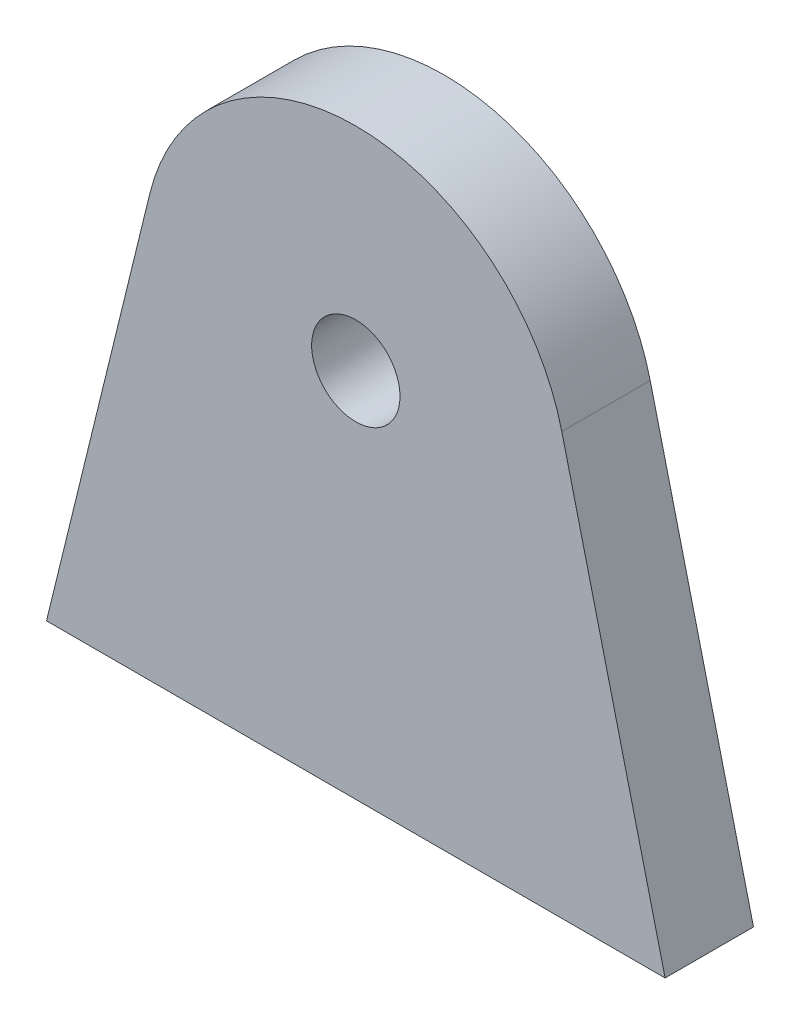
ISO-10303-21;
HEADER;
FILE_DESCRIPTION(('STEP AP214'),'2;1');
FILE_NAME('part.step','',(''),(''),'','','');
FILE_SCHEMA(('AUTOMOTIVE_DESIGN { 1 0 10303 214 1 1 1 1 }'));
ENDSEC;
DATA;
#1=APPLICATION_CONTEXT('core data for automotive mechanical design processes');
#2=APPLICATION_PROTOCOL_DEFINITION('international standard','automotive_design',2000,#1);
#3=PRODUCT_CONTEXT('',#1,'mechanical');
#4=PRODUCT('Part','Part','',(#3));
#5=PRODUCT_RELATED_PRODUCT_CATEGORY('part','',(#4));
#6=PRODUCT_DEFINITION_FORMATION('','',#4);
#7=PRODUCT_DEFINITION_CONTEXT('part definition',#1,'design');
#8=PRODUCT_DEFINITION('design','',#6,#7);
#9=PRODUCT_DEFINITION_SHAPE('','',#8);
#10=(LENGTH_UNIT() NAMED_UNIT(*) SI_UNIT(.MILLI.,.METRE.));
#11=(NAMED_UNIT(*) PLANE_ANGLE_UNIT() SI_UNIT($,.RADIAN.));
#12=(NAMED_UNIT(*) SI_UNIT($,.STERADIAN.) SOLID_ANGLE_UNIT());
#13=UNCERTAINTY_MEASURE_WITH_UNIT(LENGTH_MEASURE(1.E-05),#10,'distance_accuracy_value','');
#14=(GEOMETRIC_REPRESENTATION_CONTEXT(3) GLOBAL_UNCERTAINTY_ASSIGNED_CONTEXT((#13)) GLOBAL_UNIT_ASSIGNED_CONTEXT((#10,
#11,#12)) REPRESENTATION_CONTEXT('',''));
#15=CARTESIAN_POINT('',(0.,0.,0.));
#16=DIRECTION('',(0.,0.,1.));
#17=DIRECTION('',(1.,0.,0.));
#18=AXIS2_PLACEMENT_3D('',#15,#16,#17);
#19=CARTESIAN_POINT('',(0.,21.,5.));
#20=DIRECTION('',(0.,0.,-1.));
#21=DIRECTION('',(-1.,0.,0.));
#22=AXIS2_PLACEMENT_3D('',#19,#20,#21);
#23=PLANE('',#22);
#24=DIRECTION('',(-0.237965999569796,-0.97127348519804,0.));
#25=VECTOR('',#24,1.);
#26=CARTESIAN_POINT('',(-17.5,0.,5.));
#27=LINE('',#26,#25);
#28=CARTESIAN_POINT('',(-11.6552818223765,23.8555919948375,5.));
#29=VERTEX_POINT('',#28);
#30=CARTESIAN_POINT('',(-17.5,0.,5.));
#31=VERTEX_POINT('',#30);
#32=EDGE_CURVE('E85',#29,#31,#27,.T.);
#33=ORIENTED_EDGE('',*,*,#32,.T.);
#34=DIRECTION('',(1.,0.,0.));
#35=VECTOR('',#34,1.);
#36=CARTESIAN_POINT('',(17.5,0.,5.));
#37=LINE('',#36,#35);
#38=CARTESIAN_POINT('',(17.5,0.,5.));
#39=VERTEX_POINT('',#38);
#40=EDGE_CURVE('E80',#31,#39,#37,.T.);
#41=ORIENTED_EDGE('',*,*,#40,.T.);
#42=DIRECTION('',(-0.237965999569796,0.97127348519804,0.));
#43=VECTOR('',#42,1.);
#44=CARTESIAN_POINT('',(17.5,0.,5.));
#45=LINE('',#44,#43);
#46=CARTESIAN_POINT('',(11.6552818223765,23.8555919948375,5.));
#47=VERTEX_POINT('',#46);
#48=EDGE_CURVE('E83',#39,#47,#45,.T.);
#49=ORIENTED_EDGE('',*,*,#48,.T.);
#50=CARTESIAN_POINT('',(0.,21.,5.));
#51=DIRECTION('',(0.,0.,1.));
#52=DIRECTION('',(-1.,0.,0.));
#53=AXIS2_PLACEMENT_3D('',#50,#51,#52);
#54=CIRCLE('',#53,12.);
#55=EDGE_CURVE('E50',#47,#29,#54,.T.);
#56=ORIENTED_EDGE('',*,*,#55,.T.);
#57=EDGE_LOOP('',(#33,#41,#49,#56));
#58=FACE_BOUND('',#57,.T.);
#59=CARTESIAN_POINT('',(0.,21.,5.));
#60=DIRECTION('',(0.,0.,1.));
#61=DIRECTION('',(1.,0.,0.));
#62=AXIS2_PLACEMENT_3D('',#59,#60,#61);
#63=CIRCLE('',#62,2.5);
#64=CARTESIAN_POINT('',(2.5,21.,5.));
#65=VERTEX_POINT('',#64);
#66=EDGE_CURVE('E100',#65,#65,#63,.T.);
#67=ORIENTED_EDGE('',*,*,#66,.F.);
#68=EDGE_LOOP('',(#67));
#69=FACE_BOUND('',#68,.T.);
#70=ADVANCED_FACE('F33',(#58,#69),#23,.F.);
#71=CARTESIAN_POINT('',(0.,21.,0.));
#72=DIRECTION('',(0.,0.,-1.));
#73=DIRECTION('',(-1.,0.,0.));
#74=AXIS2_PLACEMENT_3D('',#71,#72,#73);
#75=PLANE('',#74);
#76=DIRECTION('',(-0.237965999569796,-0.97127348519804,0.));
#77=VECTOR('',#76,1.);
#78=CARTESIAN_POINT('',(-17.5,0.,0.));
#79=LINE('',#78,#77);
#80=CARTESIAN_POINT('',(-11.6552818223765,23.8555919948375,0.));
#81=VERTEX_POINT('',#80);
#82=CARTESIAN_POINT('',(-17.5,0.,0.));
#83=VERTEX_POINT('',#82);
#84=EDGE_CURVE('E97',#81,#83,#79,.T.);
#85=ORIENTED_EDGE('',*,*,#84,.F.);
#86=CARTESIAN_POINT('',(0.,21.,0.));
#87=DIRECTION('',(0.,0.,1.));
#88=DIRECTION('',(-1.,0.,0.));
#89=AXIS2_PLACEMENT_3D('',#86,#87,#88);
#90=CIRCLE('',#89,12.);
#91=CARTESIAN_POINT('',(11.6552818223765,23.8555919948375,0.));
#92=VERTEX_POINT('',#91);
#93=EDGE_CURVE('E73',#92,#81,#90,.T.);
#94=ORIENTED_EDGE('',*,*,#93,.F.);
#95=DIRECTION('',(-0.237965999569796,0.97127348519804,0.));
#96=VECTOR('',#95,1.);
#97=CARTESIAN_POINT('',(17.5,0.,0.));
#98=LINE('',#97,#96);
#99=CARTESIAN_POINT('',(17.5,0.,0.));
#100=VERTEX_POINT('',#99);
#101=EDGE_CURVE('E67',#100,#92,#98,.T.);
#102=ORIENTED_EDGE('',*,*,#101,.F.);
#103=DIRECTION('',(1.,0.,0.));
#104=VECTOR('',#103,1.);
#105=CARTESIAN_POINT('',(17.5,0.,0.));
#106=LINE('',#105,#104);
#107=EDGE_CURVE('E89',#83,#100,#106,.T.);
#108=ORIENTED_EDGE('',*,*,#107,.F.);
#109=EDGE_LOOP('',(#85,#94,#102,#108));
#110=FACE_BOUND('',#109,.T.);
#111=CARTESIAN_POINT('',(0.,21.,0.));
#112=DIRECTION('',(0.,0.,1.));
#113=DIRECTION('',(1.,0.,0.));
#114=AXIS2_PLACEMENT_3D('',#111,#112,#113);
#115=CIRCLE('',#114,2.5);
#116=CARTESIAN_POINT('',(2.5,21.,0.));
#117=VERTEX_POINT('',#116);
#118=EDGE_CURVE('E112',#117,#117,#115,.T.);
#119=ORIENTED_EDGE('',*,*,#118,.T.);
#120=EDGE_LOOP('',(#119));
#121=FACE_BOUND('',#120,.T.);
#122=ADVANCED_FACE('F108',(#110,#121),#75,.T.);
#123=CARTESIAN_POINT('',(-17.5,0.,5.));
#124=DIRECTION('',(0.97127348519804,-0.237965999569796,0.));
#125=DIRECTION('',(0.237965999569796,0.971273485198041,0.));
#126=AXIS2_PLACEMENT_3D('',#123,#124,#125);
#127=PLANE('',#126);
#128=ORIENTED_EDGE('',*,*,#84,.T.);
#129=DIRECTION('',(0.,0.,-1.));
#130=VECTOR('',#129,1.);
#131=CARTESIAN_POINT('',(-17.5,0.,5.));
#132=LINE('',#131,#130);
#133=EDGE_CURVE('E11',#31,#83,#132,.T.);
#134=ORIENTED_EDGE('',*,*,#133,.F.);
#135=ORIENTED_EDGE('',*,*,#32,.F.);
#136=DIRECTION('',(0.,0.,-1.));
#137=VECTOR('',#136,1.);
#138=CARTESIAN_POINT('',(-11.6552818223765,23.8555919948375,5.));
#139=LINE('',#138,#137);
#140=EDGE_CURVE('E93',#29,#81,#139,.T.);
#141=ORIENTED_EDGE('',*,*,#140,.T.);
#142=EDGE_LOOP('',(#128,#134,#135,#141));
#143=FACE_BOUND('',#142,.T.);
#144=ADVANCED_FACE('F35',(#143),#127,.F.);
#145=CARTESIAN_POINT('',(17.5,0.,5.));
#146=DIRECTION('',(0.,1.,0.));
#147=DIRECTION('',(0.,0.,1.));
#148=AXIS2_PLACEMENT_3D('',#145,#146,#147);
#149=PLANE('',#148);
#150=ORIENTED_EDGE('',*,*,#107,.T.);
#151=DIRECTION('',(0.,0.,-1.));
#152=VECTOR('',#151,1.);
#153=CARTESIAN_POINT('',(17.5,0.,5.));
#154=LINE('',#153,#152);
#155=EDGE_CURVE('E42',#39,#100,#154,.T.);
#156=ORIENTED_EDGE('',*,*,#155,.F.);
#157=ORIENTED_EDGE('',*,*,#40,.F.);
#158=ORIENTED_EDGE('',*,*,#133,.T.);
#159=EDGE_LOOP('',(#150,#156,#157,#158));
#160=FACE_BOUND('',#159,.T.);
#161=ADVANCED_FACE('F88',(#160),#149,.F.);
#162=CARTESIAN_POINT('',(17.5,0.,5.));
#163=DIRECTION('',(-0.97127348519804,-0.237965999569796,0.));
#164=DIRECTION('',(0.237965999569796,-0.971273485198041,0.));
#165=AXIS2_PLACEMENT_3D('',#162,#163,#164);
#166=PLANE('',#165);
#167=ORIENTED_EDGE('',*,*,#101,.T.);
#168=DIRECTION('',(0.,0.,-1.));
#169=VECTOR('',#168,1.);
#170=CARTESIAN_POINT('',(11.6552818223765,23.8555919948375,5.));
#171=LINE('',#170,#169);
#172=EDGE_CURVE('E90',#47,#92,#171,.T.);
#173=ORIENTED_EDGE('',*,*,#172,.F.);
#174=ORIENTED_EDGE('',*,*,#48,.F.);
#175=ORIENTED_EDGE('',*,*,#155,.T.);
#176=EDGE_LOOP('',(#167,#173,#174,#175));
#177=FACE_BOUND('',#176,.T.);
#178=ADVANCED_FACE('F91',(#177),#166,.F.);
#179=CARTESIAN_POINT('',(0.,21.,5.));
#180=DIRECTION('',(0.,0.,-1.));
#181=DIRECTION('',(-1.,0.,0.));
#182=AXIS2_PLACEMENT_3D('',#179,#180,#181);
#183=CYLINDRICAL_SURFACE('',#182,12.);
#184=ORIENTED_EDGE('',*,*,#93,.T.);
#185=ORIENTED_EDGE('',*,*,#140,.F.);
#186=ORIENTED_EDGE('',*,*,#55,.F.);
#187=ORIENTED_EDGE('',*,*,#172,.T.);
#188=EDGE_LOOP('',(#184,#185,#186,#187));
#189=FACE_BOUND('',#188,.T.);
#190=ADVANCED_FACE('F105',(#189),#183,.T.);
#191=CARTESIAN_POINT('',(0.,21.,5.));
#192=DIRECTION('',(0.,0.,-1.));
#193=DIRECTION('',(-1.,0.,0.));
#194=AXIS2_PLACEMENT_3D('',#191,#192,#193);
#195=CYLINDRICAL_SURFACE('',#194,2.5);
#196=ORIENTED_EDGE('',*,*,#66,.T.);
#197=EDGE_LOOP('',(#196));
#198=FACE_BOUND('',#197,.T.);
#199=ORIENTED_EDGE('',*,*,#118,.F.);
#200=EDGE_LOOP('',(#199));
#201=FACE_BOUND('',#200,.T.);
#202=ADVANCED_FACE('F118',(#198,#201),#195,.F.);
#203=CLOSED_SHELL('',(#70,#122,#144,#161,#178,#190,#202));
#204=MANIFOLD_SOLID_BREP('B2',#203);
#205=ADVANCED_BREP_SHAPE_REPRESENTATION('',(#18,#204),#14);
#206=SHAPE_DEFINITION_REPRESENTATION(#9,#205);
ENDSEC;
END-ISO-10303-21;
